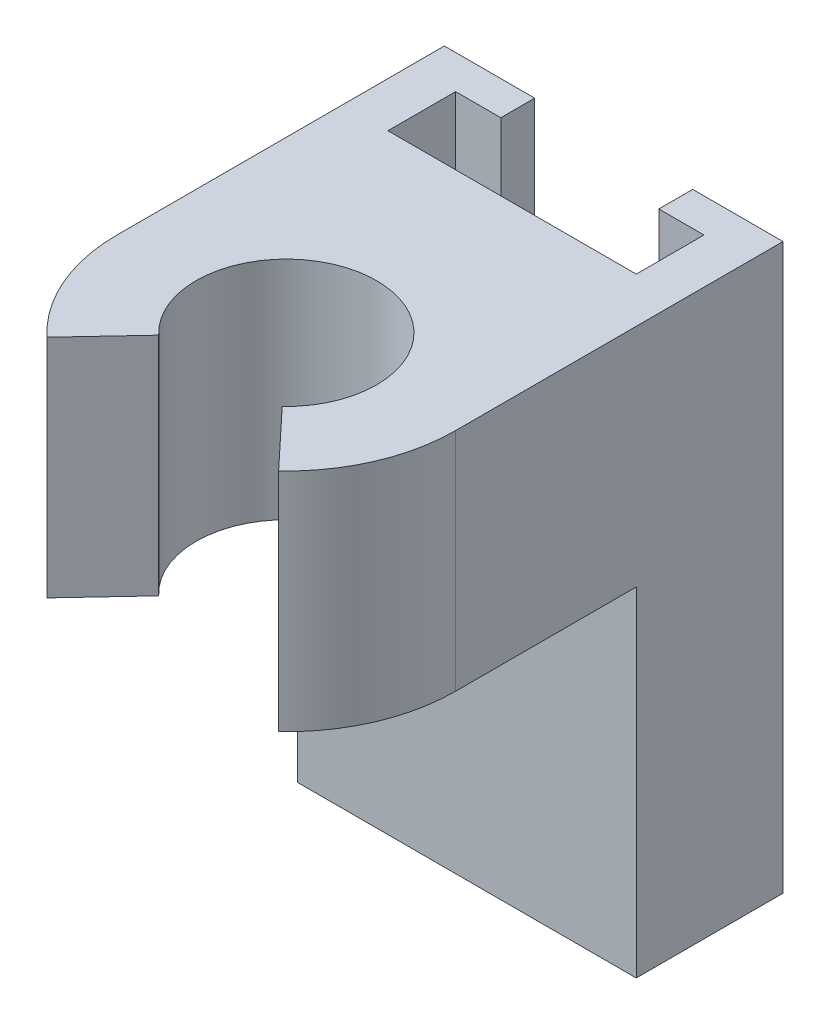
ISO-10303-21;
HEADER;
FILE_DESCRIPTION(('STEP AP214'),'2;1');
FILE_NAME('part.step','',(''),(''),'','','');
FILE_SCHEMA(('AUTOMOTIVE_DESIGN { 1 0 10303 214 1 1 1 1 }'));
ENDSEC;
DATA;
#1=APPLICATION_CONTEXT('core data for automotive mechanical design processes');
#2=APPLICATION_PROTOCOL_DEFINITION('international standard','automotive_design',2000,#1);
#3=PRODUCT_CONTEXT('',#1,'mechanical');
#4=PRODUCT('Part','Part','',(#3));
#5=PRODUCT_RELATED_PRODUCT_CATEGORY('part','',(#4));
#6=PRODUCT_DEFINITION_FORMATION('','',#4);
#7=PRODUCT_DEFINITION_CONTEXT('part definition',#1,'design');
#8=PRODUCT_DEFINITION('design','',#6,#7);
#9=PRODUCT_DEFINITION_SHAPE('','',#8);
#10=(LENGTH_UNIT() NAMED_UNIT(*) SI_UNIT(.MILLI.,.METRE.));
#11=(NAMED_UNIT(*) PLANE_ANGLE_UNIT() SI_UNIT($,.RADIAN.));
#12=(NAMED_UNIT(*) SI_UNIT($,.STERADIAN.) SOLID_ANGLE_UNIT());
#13=UNCERTAINTY_MEASURE_WITH_UNIT(LENGTH_MEASURE(1.E-05),#10,'distance_accuracy_value','');
#14=(GEOMETRIC_REPRESENTATION_CONTEXT(3) GLOBAL_UNCERTAINTY_ASSIGNED_CONTEXT((#13)) GLOBAL_UNIT_ASSIGNED_CONTEXT((#10,
#11,#12)) REPRESENTATION_CONTEXT('',''));
#15=CARTESIAN_POINT('',(0.,0.,0.));
#16=DIRECTION('',(0.,0.,1.));
#17=DIRECTION('',(1.,0.,0.));
#18=AXIS2_PLACEMENT_3D('',#15,#16,#17);
#19=CARTESIAN_POINT('',(0.,25.,-6.5));
#20=DIRECTION('',(1.,0.,0.));
#21=DIRECTION('',(0.,0.,-1.));
#22=AXIS2_PLACEMENT_3D('',#19,#20,#21);
#23=PLANE('',#22);
#24=DIRECTION('',(0.,0.,1.));
#25=VECTOR('',#24,1.);
#26=CARTESIAN_POINT('',(0.,0.,-6.5));
#27=LINE('',#26,#25);
#28=CARTESIAN_POINT('',(0.,0.,-6.5));
#29=VERTEX_POINT('',#28);
#30=CARTESIAN_POINT('',(0.,0.,0.));
#31=VERTEX_POINT('',#30);
#32=EDGE_CURVE('E161',#29,#31,#27,.T.);
#33=ORIENTED_EDGE('',*,*,#32,.T.);
#34=DIRECTION('',(0.,-1.,0.));
#35=VECTOR('',#34,1.);
#36=CARTESIAN_POINT('',(0.,25.,0.));
#37=LINE('',#36,#35);
#38=CARTESIAN_POINT('',(0.,15.,0.));
#39=VERTEX_POINT('',#38);
#40=EDGE_CURVE('E11',#39,#31,#37,.T.);
#41=ORIENTED_EDGE('',*,*,#40,.F.);
#42=DIRECTION('',(0.,0.,1.));
#43=VECTOR('',#42,1.);
#44=CARTESIAN_POINT('',(0.,15.,0.));
#45=LINE('',#44,#43);
#46=CARTESIAN_POINT('',(0.,15.,8.));
#47=VERTEX_POINT('',#46);
#48=EDGE_CURVE('E49',#39,#47,#45,.T.);
#49=ORIENTED_EDGE('',*,*,#48,.T.);
#50=DIRECTION('',(0.,1.,0.));
#51=VECTOR('',#50,1.);
#52=CARTESIAN_POINT('',(0.,15.,8.));
#53=LINE('',#52,#51);
#54=CARTESIAN_POINT('',(0.,25.,8.));
#55=VERTEX_POINT('',#54);
#56=EDGE_CURVE('E250',#47,#55,#53,.T.);
#57=ORIENTED_EDGE('',*,*,#56,.T.);
#58=DIRECTION('',(0.,0.,1.));
#59=VECTOR('',#58,1.);
#60=CARTESIAN_POINT('',(0.,25.,-6.5));
#61=LINE('',#60,#59);
#62=CARTESIAN_POINT('',(0.,25.,-6.5));
#63=VERTEX_POINT('',#62);
#64=EDGE_CURVE('E186',#63,#55,#61,.T.);
#65=ORIENTED_EDGE('',*,*,#64,.F.);
#66=DIRECTION('',(0.,-1.,0.));
#67=VECTOR('',#66,1.);
#68=CARTESIAN_POINT('',(0.,25.,-6.5));
#69=LINE('',#68,#67);
#70=EDGE_CURVE('E157',#63,#29,#69,.T.);
#71=ORIENTED_EDGE('',*,*,#70,.T.);
#72=EDGE_LOOP('',(#33,#41,#49,#57,#65,#71));
#73=FACE_BOUND('',#72,.T.);
#74=ADVANCED_FACE('F33',(#73),#23,.F.);
#75=CARTESIAN_POINT('',(0.,25.,0.));
#76=DIRECTION('',(0.,0.,-1.));
#77=DIRECTION('',(-1.,0.,0.));
#78=AXIS2_PLACEMENT_3D('',#75,#76,#77);
#79=PLANE('',#78);
#80=DIRECTION('',(0.,-1.,0.));
#81=VECTOR('',#80,1.);
#82=CARTESIAN_POINT('',(15.,25.,0.));
#83=LINE('',#82,#81);
#84=CARTESIAN_POINT('',(15.,15.,0.));
#85=VERTEX_POINT('',#84);
#86=CARTESIAN_POINT('',(15.,0.,0.));
#87=VERTEX_POINT('',#86);
#88=EDGE_CURVE('E41',#85,#87,#83,.T.);
#89=ORIENTED_EDGE('',*,*,#88,.F.);
#90=DIRECTION('',(-1.,0.,0.));
#91=VECTOR('',#90,1.);
#92=CARTESIAN_POINT('',(15.,15.,0.));
#93=LINE('',#92,#91);
#94=EDGE_CURVE('E213',#85,#39,#93,.T.);
#95=ORIENTED_EDGE('',*,*,#94,.T.);
#96=ORIENTED_EDGE('',*,*,#40,.T.);
#97=DIRECTION('',(1.,0.,0.));
#98=VECTOR('',#97,1.);
#99=CARTESIAN_POINT('',(0.,0.,0.));
#100=LINE('',#99,#98);
#101=EDGE_CURVE('E164',#31,#87,#100,.T.);
#102=ORIENTED_EDGE('',*,*,#101,.T.);
#103=EDGE_LOOP('',(#89,#95,#96,#102));
#104=FACE_BOUND('',#103,.T.);
#105=ADVANCED_FACE('F349',(#104),#79,.F.);
#106=CARTESIAN_POINT('',(15.,25.,0.));
#107=DIRECTION('',(-1.,0.,0.));
#108=DIRECTION('',(0.,0.,1.));
#109=AXIS2_PLACEMENT_3D('',#106,#107,#108);
#110=PLANE('',#109);
#111=DIRECTION('',(0.,0.,-1.));
#112=VECTOR('',#111,1.);
#113=CARTESIAN_POINT('',(15.,0.,0.));
#114=LINE('',#113,#112);
#115=CARTESIAN_POINT('',(15.,0.,-6.5));
#116=VERTEX_POINT('',#115);
#117=EDGE_CURVE('E168',#87,#116,#114,.T.);
#118=ORIENTED_EDGE('',*,*,#117,.T.);
#119=DIRECTION('',(0.,-1.,0.));
#120=VECTOR('',#119,1.);
#121=CARTESIAN_POINT('',(15.,25.,-6.5));
#122=LINE('',#121,#120);
#123=CARTESIAN_POINT('',(15.,25.,-6.5));
#124=VERTEX_POINT('',#123);
#125=EDGE_CURVE('E205',#124,#116,#122,.T.);
#126=ORIENTED_EDGE('',*,*,#125,.F.);
#127=DIRECTION('',(0.,0.,-1.));
#128=VECTOR('',#127,1.);
#129=CARTESIAN_POINT('',(15.,25.,0.));
#130=LINE('',#129,#128);
#131=CARTESIAN_POINT('',(15.,25.,8.));
#132=VERTEX_POINT('',#131);
#133=EDGE_CURVE('E110',#132,#124,#130,.T.);
#134=ORIENTED_EDGE('',*,*,#133,.F.);
#135=DIRECTION('',(0.,1.,0.));
#136=VECTOR('',#135,1.);
#137=CARTESIAN_POINT('',(15.,15.,8.));
#138=LINE('',#137,#136);
#139=CARTESIAN_POINT('',(15.,15.,8.));
#140=VERTEX_POINT('',#139);
#141=EDGE_CURVE('E253',#140,#132,#138,.T.);
#142=ORIENTED_EDGE('',*,*,#141,.F.);
#143=DIRECTION('',(0.,0.,-1.));
#144=VECTOR('',#143,1.);
#145=CARTESIAN_POINT('',(15.,15.,8.));
#146=LINE('',#145,#144);
#147=EDGE_CURVE('E216',#140,#85,#146,.T.);
#148=ORIENTED_EDGE('',*,*,#147,.T.);
#149=ORIENTED_EDGE('',*,*,#88,.T.);
#150=EDGE_LOOP('',(#118,#126,#134,#142,#148,#149));
#151=FACE_BOUND('',#150,.T.);
#152=ADVANCED_FACE('F340',(#151),#110,.F.);
#153=CARTESIAN_POINT('',(15.,25.,-6.5));
#154=DIRECTION('',(0.,0.,1.));
#155=DIRECTION('',(1.,0.,0.));
#156=AXIS2_PLACEMENT_3D('',#153,#154,#155);
#157=PLANE('',#156);
#158=DIRECTION('',(-1.,0.,0.));
#159=VECTOR('',#158,1.);
#160=CARTESIAN_POINT('',(15.,0.,-6.5));
#161=LINE('',#160,#159);
#162=CARTESIAN_POINT('',(11.,0.,-6.5));
#163=VERTEX_POINT('',#162);
#164=EDGE_CURVE('E170',#116,#163,#161,.T.);
#165=ORIENTED_EDGE('',*,*,#164,.T.);
#166=DIRECTION('',(0.,-1.,0.));
#167=VECTOR('',#166,1.);
#168=CARTESIAN_POINT('',(11.,25.,-6.5));
#169=LINE('',#168,#167);
#170=CARTESIAN_POINT('',(11.,25.,-6.5));
#171=VERTEX_POINT('',#170);
#172=EDGE_CURVE('E202',#171,#163,#169,.T.);
#173=ORIENTED_EDGE('',*,*,#172,.F.);
#174=DIRECTION('',(-1.,0.,0.));
#175=VECTOR('',#174,1.);
#176=CARTESIAN_POINT('',(15.,25.,-6.5));
#177=LINE('',#176,#175);
#178=EDGE_CURVE('E263',#124,#171,#177,.T.);
#179=ORIENTED_EDGE('',*,*,#178,.F.);
#180=ORIENTED_EDGE('',*,*,#125,.T.);
#181=EDGE_LOOP('',(#165,#173,#179,#180));
#182=FACE_BOUND('',#181,.T.);
#183=ADVANCED_FACE('F355',(#182),#157,.F.);
#184=CARTESIAN_POINT('',(11.,25.,-6.5));
#185=DIRECTION('',(1.,0.,0.));
#186=DIRECTION('',(0.,0.,-1.));
#187=AXIS2_PLACEMENT_3D('',#184,#185,#186);
#188=PLANE('',#187);
#189=DIRECTION('',(0.,0.,1.));
#190=VECTOR('',#189,1.);
#191=CARTESIAN_POINT('',(11.,0.,-6.5));
#192=LINE('',#191,#190);
#193=CARTESIAN_POINT('',(11.,0.,-5.));
#194=VERTEX_POINT('',#193);
#195=EDGE_CURVE('E172',#163,#194,#192,.T.);
#196=ORIENTED_EDGE('',*,*,#195,.T.);
#197=DIRECTION('',(0.,-1.,0.));
#198=VECTOR('',#197,1.);
#199=CARTESIAN_POINT('',(11.,25.,-5.));
#200=LINE('',#199,#198);
#201=CARTESIAN_POINT('',(11.,25.,-5.));
#202=VERTEX_POINT('',#201);
#203=EDGE_CURVE('E199',#202,#194,#200,.T.);
#204=ORIENTED_EDGE('',*,*,#203,.F.);
#205=DIRECTION('',(0.,0.,1.));
#206=VECTOR('',#205,1.);
#207=CARTESIAN_POINT('',(11.,25.,-6.5));
#208=LINE('',#207,#206);
#209=EDGE_CURVE('E265',#171,#202,#208,.T.);
#210=ORIENTED_EDGE('',*,*,#209,.F.);
#211=ORIENTED_EDGE('',*,*,#172,.T.);
#212=EDGE_LOOP('',(#196,#204,#210,#211));
#213=FACE_BOUND('',#212,.T.);
#214=ADVANCED_FACE('F362',(#213),#188,.F.);
#215=CARTESIAN_POINT('',(11.,25.,-5.));
#216=DIRECTION('',(0.,0.,-1.));
#217=DIRECTION('',(-1.,0.,0.));
#218=AXIS2_PLACEMENT_3D('',#215,#216,#217);
#219=PLANE('',#218);
#220=DIRECTION('',(1.,0.,0.));
#221=VECTOR('',#220,1.);
#222=CARTESIAN_POINT('',(11.,0.,-5.));
#223=LINE('',#222,#221);
#224=CARTESIAN_POINT('',(13.,0.,-5.));
#225=VERTEX_POINT('',#224);
#226=EDGE_CURVE('E174',#194,#225,#223,.T.);
#227=ORIENTED_EDGE('',*,*,#226,.T.);
#228=DIRECTION('',(0.,-1.,0.));
#229=VECTOR('',#228,1.);
#230=CARTESIAN_POINT('',(13.,25.,-5.));
#231=LINE('',#230,#229);
#232=CARTESIAN_POINT('',(13.,25.,-5.));
#233=VERTEX_POINT('',#232);
#234=EDGE_CURVE('E196',#233,#225,#231,.T.);
#235=ORIENTED_EDGE('',*,*,#234,.F.);
#236=DIRECTION('',(1.,0.,0.));
#237=VECTOR('',#236,1.);
#238=CARTESIAN_POINT('',(11.,25.,-5.));
#239=LINE('',#238,#237);
#240=EDGE_CURVE('E267',#202,#233,#239,.T.);
#241=ORIENTED_EDGE('',*,*,#240,.F.);
#242=ORIENTED_EDGE('',*,*,#203,.T.);
#243=EDGE_LOOP('',(#227,#235,#241,#242));
#244=FACE_BOUND('',#243,.T.);
#245=ADVANCED_FACE('F365',(#244),#219,.F.);
#246=CARTESIAN_POINT('',(13.,25.,-5.));
#247=DIRECTION('',(1.,0.,0.));
#248=DIRECTION('',(0.,0.,-1.));
#249=AXIS2_PLACEMENT_3D('',#246,#247,#248);
#250=PLANE('',#249);
#251=DIRECTION('',(0.,0.,1.));
#252=VECTOR('',#251,1.);
#253=CARTESIAN_POINT('',(13.,0.,-5.));
#254=LINE('',#253,#252);
#255=CARTESIAN_POINT('',(13.,0.,-2.));
#256=VERTEX_POINT('',#255);
#257=EDGE_CURVE('E176',#225,#256,#254,.T.);
#258=ORIENTED_EDGE('',*,*,#257,.T.);
#259=DIRECTION('',(0.,-1.,0.));
#260=VECTOR('',#259,1.);
#261=CARTESIAN_POINT('',(13.,25.,-2.));
#262=LINE('',#261,#260);
#263=CARTESIAN_POINT('',(13.,25.,-2.));
#264=VERTEX_POINT('',#263);
#265=EDGE_CURVE('E193',#264,#256,#262,.T.);
#266=ORIENTED_EDGE('',*,*,#265,.F.);
#267=DIRECTION('',(0.,0.,1.));
#268=VECTOR('',#267,1.);
#269=CARTESIAN_POINT('',(13.,25.,-5.));
#270=LINE('',#269,#268);
#271=EDGE_CURVE('E269',#233,#264,#270,.T.);
#272=ORIENTED_EDGE('',*,*,#271,.F.);
#273=ORIENTED_EDGE('',*,*,#234,.T.);
#274=EDGE_LOOP('',(#258,#266,#272,#273));
#275=FACE_BOUND('',#274,.T.);
#276=ADVANCED_FACE('F368',(#275),#250,.F.);
#277=CARTESIAN_POINT('',(13.,25.,-2.));
#278=DIRECTION('',(0.,0.,1.));
#279=DIRECTION('',(1.,0.,0.));
#280=AXIS2_PLACEMENT_3D('',#277,#278,#279);
#281=PLANE('',#280);
#282=DIRECTION('',(-1.,0.,0.));
#283=VECTOR('',#282,1.);
#284=CARTESIAN_POINT('',(13.,0.,-2.));
#285=LINE('',#284,#283);
#286=CARTESIAN_POINT('',(2.,0.,-2.));
#287=VERTEX_POINT('',#286);
#288=EDGE_CURVE('E178',#256,#287,#285,.T.);
#289=ORIENTED_EDGE('',*,*,#288,.T.);
#290=DIRECTION('',(0.,-1.,0.));
#291=VECTOR('',#290,1.);
#292=CARTESIAN_POINT('',(2.,25.,-2.));
#293=LINE('',#292,#291);
#294=CARTESIAN_POINT('',(2.,25.,-2.));
#295=VERTEX_POINT('',#294);
#296=EDGE_CURVE('E190',#295,#287,#293,.T.);
#297=ORIENTED_EDGE('',*,*,#296,.F.);
#298=DIRECTION('',(-1.,0.,0.));
#299=VECTOR('',#298,1.);
#300=CARTESIAN_POINT('',(13.,25.,-2.));
#301=LINE('',#300,#299);
#302=EDGE_CURVE('E271',#264,#295,#301,.T.);
#303=ORIENTED_EDGE('',*,*,#302,.F.);
#304=ORIENTED_EDGE('',*,*,#265,.T.);
#305=EDGE_LOOP('',(#289,#297,#303,#304));
#306=FACE_BOUND('',#305,.T.);
#307=ADVANCED_FACE('F277',(#306),#281,.F.);
#308=CARTESIAN_POINT('',(2.,25.,-2.));
#309=DIRECTION('',(-1.,0.,0.));
#310=DIRECTION('',(0.,0.,1.));
#311=AXIS2_PLACEMENT_3D('',#308,#309,#310);
#312=PLANE('',#311);
#313=DIRECTION('',(0.,0.,-1.));
#314=VECTOR('',#313,1.);
#315=CARTESIAN_POINT('',(2.,0.,-2.));
#316=LINE('',#315,#314);
#317=CARTESIAN_POINT('',(2.,0.,-5.));
#318=VERTEX_POINT('',#317);
#319=EDGE_CURVE('E180',#287,#318,#316,.T.);
#320=ORIENTED_EDGE('',*,*,#319,.T.);
#321=DIRECTION('',(0.,-1.,0.));
#322=VECTOR('',#321,1.);
#323=CARTESIAN_POINT('',(2.,25.,-5.));
#324=LINE('',#323,#322);
#325=CARTESIAN_POINT('',(2.,25.,-5.));
#326=VERTEX_POINT('',#325);
#327=EDGE_CURVE('E152',#326,#318,#324,.T.);
#328=ORIENTED_EDGE('',*,*,#327,.F.);
#329=DIRECTION('',(0.,0.,-1.));
#330=VECTOR('',#329,1.);
#331=CARTESIAN_POINT('',(2.,25.,-2.));
#332=LINE('',#331,#330);
#333=EDGE_CURVE('E140',#295,#326,#332,.T.);
#334=ORIENTED_EDGE('',*,*,#333,.F.);
#335=ORIENTED_EDGE('',*,*,#296,.T.);
#336=EDGE_LOOP('',(#320,#328,#334,#335));
#337=FACE_BOUND('',#336,.T.);
#338=ADVANCED_FACE('F281',(#337),#312,.F.);
#339=CARTESIAN_POINT('',(2.,25.,-5.));
#340=DIRECTION('',(0.,0.,-1.));
#341=DIRECTION('',(-1.,0.,0.));
#342=AXIS2_PLACEMENT_3D('',#339,#340,#341);
#343=PLANE('',#342);
#344=DIRECTION('',(1.,0.,0.));
#345=VECTOR('',#344,1.);
#346=CARTESIAN_POINT('',(2.,0.,-5.));
#347=LINE('',#346,#345);
#348=CARTESIAN_POINT('',(4.,0.,-5.));
#349=VERTEX_POINT('',#348);
#350=EDGE_CURVE('E149',#318,#349,#347,.T.);
#351=ORIENTED_EDGE('',*,*,#350,.T.);
#352=DIRECTION('',(0.,-1.,0.));
#353=VECTOR('',#352,1.);
#354=CARTESIAN_POINT('',(4.,25.,-5.));
#355=LINE('',#354,#353);
#356=CARTESIAN_POINT('',(4.,25.,-5.));
#357=VERTEX_POINT('',#356);
#358=EDGE_CURVE('E146',#357,#349,#355,.T.);
#359=ORIENTED_EDGE('',*,*,#358,.F.);
#360=DIRECTION('',(1.,0.,0.));
#361=VECTOR('',#360,1.);
#362=CARTESIAN_POINT('',(2.,25.,-5.));
#363=LINE('',#362,#361);
#364=EDGE_CURVE('E133',#326,#357,#363,.T.);
#365=ORIENTED_EDGE('',*,*,#364,.F.);
#366=ORIENTED_EDGE('',*,*,#327,.T.);
#367=EDGE_LOOP('',(#351,#359,#365,#366));
#368=FACE_BOUND('',#367,.T.);
#369=ADVANCED_FACE('F147',(#368),#343,.F.);
#370=CARTESIAN_POINT('',(4.,25.,-5.));
#371=DIRECTION('',(-1.,0.,0.));
#372=DIRECTION('',(0.,0.,1.));
#373=AXIS2_PLACEMENT_3D('',#370,#371,#372);
#374=PLANE('',#373);
#375=DIRECTION('',(0.,0.,-1.));
#376=VECTOR('',#375,1.);
#377=CARTESIAN_POINT('',(4.,0.,-5.));
#378=LINE('',#377,#376);
#379=CARTESIAN_POINT('',(4.,0.,-6.5));
#380=VERTEX_POINT('',#379);
#381=EDGE_CURVE('E183',#349,#380,#378,.T.);
#382=ORIENTED_EDGE('',*,*,#381,.T.);
#383=DIRECTION('',(0.,-1.,0.));
#384=VECTOR('',#383,1.);
#385=CARTESIAN_POINT('',(4.,25.,-6.5));
#386=LINE('',#385,#384);
#387=CARTESIAN_POINT('',(4.,25.,-6.5));
#388=VERTEX_POINT('',#387);
#389=EDGE_CURVE('E153',#388,#380,#386,.T.);
#390=ORIENTED_EDGE('',*,*,#389,.F.);
#391=DIRECTION('',(0.,0.,-1.));
#392=VECTOR('',#391,1.);
#393=CARTESIAN_POINT('',(4.,25.,-5.));
#394=LINE('',#393,#392);
#395=EDGE_CURVE('E137',#357,#388,#394,.T.);
#396=ORIENTED_EDGE('',*,*,#395,.F.);
#397=ORIENTED_EDGE('',*,*,#358,.T.);
#398=EDGE_LOOP('',(#382,#390,#396,#397));
#399=FACE_BOUND('',#398,.T.);
#400=ADVANCED_FACE('F155',(#399),#374,.F.);
#401=CARTESIAN_POINT('',(4.,25.,-6.5));
#402=DIRECTION('',(0.,0.,1.));
#403=DIRECTION('',(1.,0.,0.));
#404=AXIS2_PLACEMENT_3D('',#401,#402,#403);
#405=PLANE('',#404);
#406=DIRECTION('',(-1.,0.,0.));
#407=VECTOR('',#406,1.);
#408=CARTESIAN_POINT('',(4.,0.,-6.5));
#409=LINE('',#408,#407);
#410=EDGE_CURVE('E102',#380,#29,#409,.T.);
#411=ORIENTED_EDGE('',*,*,#410,.T.);
#412=ORIENTED_EDGE('',*,*,#70,.F.);
#413=DIRECTION('',(-1.,0.,0.));
#414=VECTOR('',#413,1.);
#415=CARTESIAN_POINT('',(4.,25.,-6.5));
#416=LINE('',#415,#414);
#417=EDGE_CURVE('E58',#388,#63,#416,.T.);
#418=ORIENTED_EDGE('',*,*,#417,.F.);
#419=ORIENTED_EDGE('',*,*,#389,.T.);
#420=EDGE_LOOP('',(#411,#412,#418,#419));
#421=FACE_BOUND('',#420,.T.);
#422=ADVANCED_FACE('F285',(#421),#405,.F.);
#423=CARTESIAN_POINT('',(0.,25.,0.));
#424=DIRECTION('',(0.,1.,0.));
#425=DIRECTION('',(0.,0.,1.));
#426=AXIS2_PLACEMENT_3D('',#423,#424,#425);
#427=PLANE('',#426);
#428=ORIENTED_EDGE('',*,*,#64,.T.);
#429=CARTESIAN_POINT('',(7.5,25.,8.));
#430=DIRECTION('',(0.,1.,0.));
#431=DIRECTION('',(0.,0.,1.));
#432=AXIS2_PLACEMENT_3D('',#429,#430,#431);
#433=CIRCLE('',#432,7.5);
#434=CARTESIAN_POINT('',(2.37044153339003,25.,13.4715290310506));
#435=VERTEX_POINT('',#434);
#436=EDGE_CURVE('E238',#55,#435,#433,.T.);
#437=ORIENTED_EDGE('',*,*,#436,.T.);
#438=DIRECTION('',(0.68394112888133,0.,-0.729537204140085));
#439=VECTOR('',#438,1.);
#440=CARTESIAN_POINT('',(4.76423548447468,25.,10.9181488165603));
#441=LINE('',#440,#439);
#442=CARTESIAN_POINT('',(4.76423548447468,25.,10.9181488165603));
#443=VERTEX_POINT('',#442);
#444=EDGE_CURVE('E241',#435,#443,#441,.T.);
#445=ORIENTED_EDGE('',*,*,#444,.T.);
#446=CARTESIAN_POINT('',(7.5,25.,8.));
#447=DIRECTION('',(0.,-1.,0.));
#448=DIRECTION('',(0.,0.,1.));
#449=AXIS2_PLACEMENT_3D('',#446,#447,#448);
#450=CIRCLE('',#449,4.);
#451=CARTESIAN_POINT('',(10.2357645155253,25.,10.9181488165603));
#452=VERTEX_POINT('',#451);
#453=EDGE_CURVE('E230',#443,#452,#450,.T.);
#454=ORIENTED_EDGE('',*,*,#453,.T.);
#455=DIRECTION('',(0.68394112888133,0.,0.729537204140085));
#456=VECTOR('',#455,1.);
#457=CARTESIAN_POINT('',(10.2357645155253,25.,10.9181488165603));
#458=LINE('',#457,#456);
#459=CARTESIAN_POINT('',(12.62955846661,25.,13.4715290310506));
#460=VERTEX_POINT('',#459);
#461=EDGE_CURVE('E233',#452,#460,#458,.T.);
#462=ORIENTED_EDGE('',*,*,#461,.T.);
#463=CARTESIAN_POINT('',(7.5,25.,8.));
#464=DIRECTION('',(0.,1.,0.));
#465=DIRECTION('',(0.,0.,1.));
#466=AXIS2_PLACEMENT_3D('',#463,#464,#465);
#467=CIRCLE('',#466,7.5);
#468=EDGE_CURVE('E236',#460,#132,#467,.T.);
#469=ORIENTED_EDGE('',*,*,#468,.T.);
#470=ORIENTED_EDGE('',*,*,#133,.T.);
#471=ORIENTED_EDGE('',*,*,#178,.T.);
#472=ORIENTED_EDGE('',*,*,#209,.T.);
#473=ORIENTED_EDGE('',*,*,#240,.T.);
#474=ORIENTED_EDGE('',*,*,#271,.T.);
#475=ORIENTED_EDGE('',*,*,#302,.T.);
#476=ORIENTED_EDGE('',*,*,#333,.T.);
#477=ORIENTED_EDGE('',*,*,#364,.T.);
#478=ORIENTED_EDGE('',*,*,#395,.T.);
#479=ORIENTED_EDGE('',*,*,#417,.T.);
#480=EDGE_LOOP('',(#428,#437,#445,#454,#462,#469,#470,#471,#472,#473,#474,#475,#476,#477,#478,#479));
#481=FACE_BOUND('',#480,.T.);
#482=ADVANCED_FACE('F135',(#481),#427,.T.);
#483=CARTESIAN_POINT('',(0.,0.,0.));
#484=DIRECTION('',(0.,1.,0.));
#485=DIRECTION('',(0.,0.,1.));
#486=AXIS2_PLACEMENT_3D('',#483,#484,#485);
#487=PLANE('',#486);
#488=ORIENTED_EDGE('',*,*,#32,.F.);
#489=ORIENTED_EDGE('',*,*,#410,.F.);
#490=ORIENTED_EDGE('',*,*,#381,.F.);
#491=ORIENTED_EDGE('',*,*,#350,.F.);
#492=ORIENTED_EDGE('',*,*,#319,.F.);
#493=ORIENTED_EDGE('',*,*,#288,.F.);
#494=ORIENTED_EDGE('',*,*,#257,.F.);
#495=ORIENTED_EDGE('',*,*,#226,.F.);
#496=ORIENTED_EDGE('',*,*,#195,.F.);
#497=ORIENTED_EDGE('',*,*,#164,.F.);
#498=ORIENTED_EDGE('',*,*,#117,.F.);
#499=ORIENTED_EDGE('',*,*,#101,.F.);
#500=EDGE_LOOP('',(#488,#489,#490,#491,#492,#493,#494,#495,#496,#497,#498,#499));
#501=FACE_BOUND('',#500,.T.);
#502=ADVANCED_FACE('F284',(#501),#487,.F.);
#503=CARTESIAN_POINT('',(7.5,15.,8.));
#504=DIRECTION('',(0.,1.,0.));
#505=DIRECTION('',(0.,0.,1.));
#506=AXIS2_PLACEMENT_3D('',#503,#504,#505);
#507=CYLINDRICAL_SURFACE('',#506,4.);
#508=ORIENTED_EDGE('',*,*,#453,.F.);
#509=DIRECTION('',(0.,1.,0.));
#510=VECTOR('',#509,1.);
#511=CARTESIAN_POINT('',(4.76423548447468,15.,10.9181488165603));
#512=LINE('',#511,#510);
#513=CARTESIAN_POINT('',(4.76423548447468,15.,10.9181488165603));
#514=VERTEX_POINT('',#513);
#515=EDGE_CURVE('E165',#514,#443,#512,.T.);
#516=ORIENTED_EDGE('',*,*,#515,.F.);
#517=CARTESIAN_POINT('',(7.5,15.,8.));
#518=DIRECTION('',(0.,-1.,0.));
#519=DIRECTION('',(0.,0.,1.));
#520=AXIS2_PLACEMENT_3D('',#517,#518,#519);
#521=CIRCLE('',#520,4.);
#522=CARTESIAN_POINT('',(10.2357645155253,15.,10.9181488165603));
#523=VERTEX_POINT('',#522);
#524=EDGE_CURVE('E244',#514,#523,#521,.T.);
#525=ORIENTED_EDGE('',*,*,#524,.T.);
#526=DIRECTION('',(0.,1.,0.));
#527=VECTOR('',#526,1.);
#528=CARTESIAN_POINT('',(10.2357645155253,15.,10.9181488165603));
#529=LINE('',#528,#527);
#530=EDGE_CURVE('E229',#523,#452,#529,.T.);
#531=ORIENTED_EDGE('',*,*,#530,.T.);
#532=EDGE_LOOP('',(#508,#516,#525,#531));
#533=FACE_BOUND('',#532,.T.);
#534=ADVANCED_FACE('F329',(#533),#507,.F.);
#535=CARTESIAN_POINT('',(4.76423548447468,15.,10.9181488165603));
#536=DIRECTION('',(0.729537204140085,0.,0.68394112888133));
#537=DIRECTION('',(0.68394112888133,0.,-0.729537204140085));
#538=AXIS2_PLACEMENT_3D('',#535,#536,#537);
#539=PLANE('',#538);
#540=ORIENTED_EDGE('',*,*,#444,.F.);
#541=DIRECTION('',(0.,1.,0.));
#542=VECTOR('',#541,1.);
#543=CARTESIAN_POINT('',(2.37044153339003,15.,13.4715290310506));
#544=LINE('',#543,#542);
#545=CARTESIAN_POINT('',(2.37044153339003,15.,13.4715290310506));
#546=VERTEX_POINT('',#545);
#547=EDGE_CURVE('E247',#546,#435,#544,.T.);
#548=ORIENTED_EDGE('',*,*,#547,.F.);
#549=DIRECTION('',(0.68394112888133,0.,-0.729537204140085));
#550=VECTOR('',#549,1.);
#551=CARTESIAN_POINT('',(4.76423548447468,15.,10.9181488165603));
#552=LINE('',#551,#550);
#553=EDGE_CURVE('E226',#546,#514,#552,.T.);
#554=ORIENTED_EDGE('',*,*,#553,.T.);
#555=ORIENTED_EDGE('',*,*,#515,.T.);
#556=EDGE_LOOP('',(#540,#548,#554,#555));
#557=FACE_BOUND('',#556,.T.);
#558=ADVANCED_FACE('F324',(#557),#539,.T.);
#559=CARTESIAN_POINT('',(7.5,15.,8.));
#560=DIRECTION('',(0.,1.,0.));
#561=DIRECTION('',(0.,0.,1.));
#562=AXIS2_PLACEMENT_3D('',#559,#560,#561);
#563=CYLINDRICAL_SURFACE('',#562,7.5);
#564=ORIENTED_EDGE('',*,*,#436,.F.);
#565=ORIENTED_EDGE('',*,*,#56,.F.);
#566=CARTESIAN_POINT('',(7.5,15.,8.));
#567=DIRECTION('',(0.,1.,0.));
#568=DIRECTION('',(0.,0.,1.));
#569=AXIS2_PLACEMENT_3D('',#566,#567,#568);
#570=CIRCLE('',#569,7.5);
#571=EDGE_CURVE('E223',#47,#546,#570,.T.);
#572=ORIENTED_EDGE('',*,*,#571,.T.);
#573=ORIENTED_EDGE('',*,*,#547,.T.);
#574=EDGE_LOOP('',(#564,#565,#572,#573));
#575=FACE_BOUND('',#574,.T.);
#576=ADVANCED_FACE('F489',(#575),#563,.T.);
#577=CARTESIAN_POINT('',(7.5,15.,8.));
#578=DIRECTION('',(0.,1.,0.));
#579=DIRECTION('',(0.,0.,1.));
#580=AXIS2_PLACEMENT_3D('',#577,#578,#579);
#581=CYLINDRICAL_SURFACE('',#580,7.5);
#582=ORIENTED_EDGE('',*,*,#468,.F.);
#583=DIRECTION('',(0.,1.,0.));
#584=VECTOR('',#583,1.);
#585=CARTESIAN_POINT('',(12.62955846661,15.,13.4715290310506));
#586=LINE('',#585,#584);
#587=CARTESIAN_POINT('',(12.62955846661,15.,13.4715290310506));
#588=VERTEX_POINT('',#587);
#589=EDGE_CURVE('E256',#588,#460,#586,.T.);
#590=ORIENTED_EDGE('',*,*,#589,.F.);
#591=CARTESIAN_POINT('',(7.5,15.,8.));
#592=DIRECTION('',(0.,1.,0.));
#593=DIRECTION('',(0.,0.,1.));
#594=AXIS2_PLACEMENT_3D('',#591,#592,#593);
#595=CIRCLE('',#594,7.5);
#596=EDGE_CURVE('E221',#588,#140,#595,.T.);
#597=ORIENTED_EDGE('',*,*,#596,.T.);
#598=ORIENTED_EDGE('',*,*,#141,.T.);
#599=EDGE_LOOP('',(#582,#590,#597,#598));
#600=FACE_BOUND('',#599,.T.);
#601=ADVANCED_FACE('F336',(#600),#581,.T.);
#602=CARTESIAN_POINT('',(10.2357645155253,15.,10.9181488165603));
#603=DIRECTION('',(-0.729537204140085,0.,0.68394112888133));
#604=DIRECTION('',(0.68394112888133,0.,0.729537204140085));
#605=AXIS2_PLACEMENT_3D('',#602,#603,#604);
#606=PLANE('',#605);
#607=ORIENTED_EDGE('',*,*,#461,.F.);
#608=ORIENTED_EDGE('',*,*,#530,.F.);
#609=DIRECTION('',(0.68394112888133,0.,0.729537204140085));
#610=VECTOR('',#609,1.);
#611=CARTESIAN_POINT('',(10.2357645155253,15.,10.9181488165603));
#612=LINE('',#611,#610);
#613=EDGE_CURVE('E332',#523,#588,#612,.T.);
#614=ORIENTED_EDGE('',*,*,#613,.T.);
#615=ORIENTED_EDGE('',*,*,#589,.T.);
#616=EDGE_LOOP('',(#607,#608,#614,#615));
#617=FACE_BOUND('',#616,.T.);
#618=ADVANCED_FACE('F331',(#617),#606,.T.);
#619=CARTESIAN_POINT('',(7.5,15.,8.));
#620=DIRECTION('',(0.,1.,0.));
#621=DIRECTION('',(0.,0.,1.));
#622=AXIS2_PLACEMENT_3D('',#619,#620,#621);
#623=PLANE('',#622);
#624=ORIENTED_EDGE('',*,*,#524,.F.);
#625=ORIENTED_EDGE('',*,*,#553,.F.);
#626=ORIENTED_EDGE('',*,*,#571,.F.);
#627=ORIENTED_EDGE('',*,*,#48,.F.);
#628=ORIENTED_EDGE('',*,*,#94,.F.);
#629=ORIENTED_EDGE('',*,*,#147,.F.);
#630=ORIENTED_EDGE('',*,*,#596,.F.);
#631=ORIENTED_EDGE('',*,*,#613,.F.);
#632=EDGE_LOOP('',(#624,#625,#626,#627,#628,#629,#630,#631));
#633=FACE_BOUND('',#632,.T.);
#634=ADVANCED_FACE('F342',(#633),#623,.F.);
#635=CLOSED_SHELL('',(#74,#105,#152,#183,#214,#245,#276,#307,#338,#369,#400,#422,#482,#502,#534,
#558,#576,#601,#618,#634));
#636=MANIFOLD_SOLID_BREP('B2',#635);
#637=ADVANCED_BREP_SHAPE_REPRESENTATION('',(#18,#636),#14);
#638=SHAPE_DEFINITION_REPRESENTATION(#9,#637);
ENDSEC;
END-ISO-10303-21;
